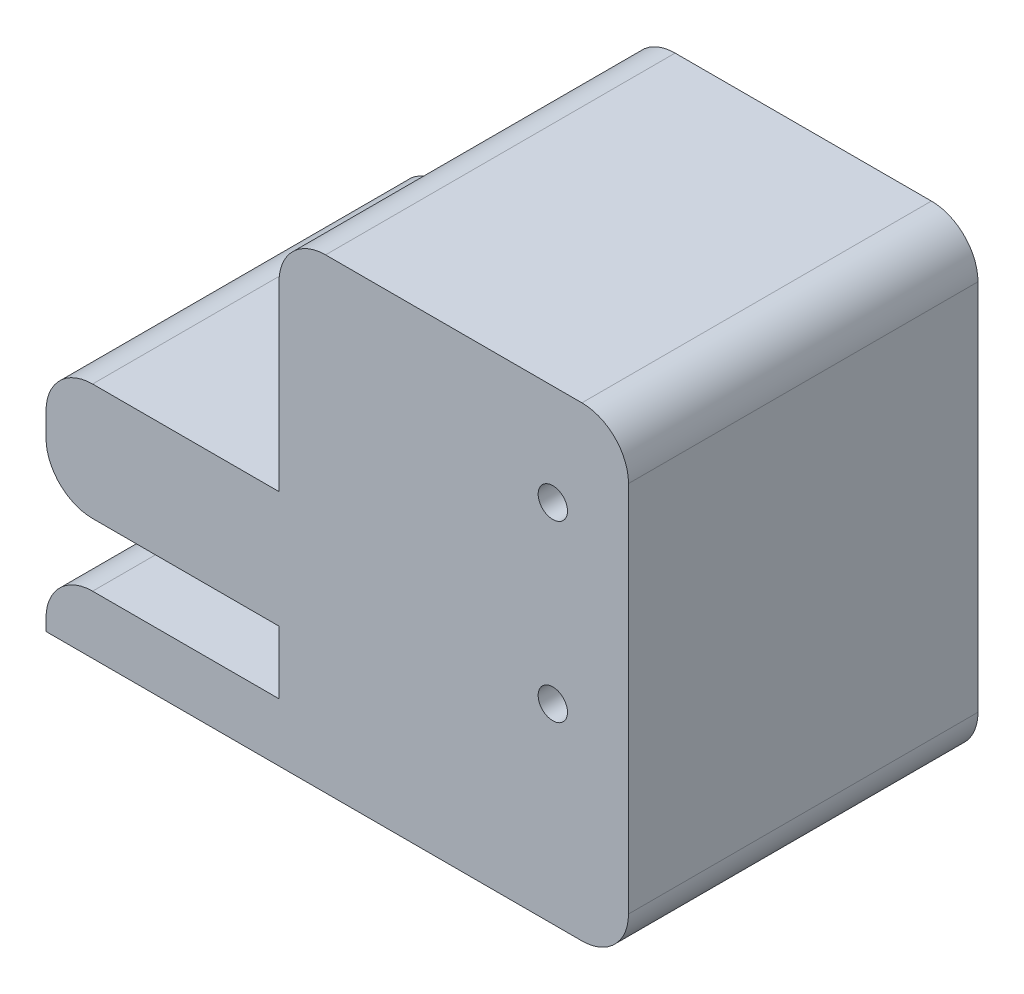
ISO-10303-21;
HEADER;
FILE_DESCRIPTION(('STEP AP214'),'2;1');
FILE_NAME('part.step','',(''),(''),'','','');
FILE_SCHEMA(('AUTOMOTIVE_DESIGN { 1 0 10303 214 1 1 1 1 }'));
ENDSEC;
DATA;
#1=APPLICATION_CONTEXT('core data for automotive mechanical design processes');
#2=APPLICATION_PROTOCOL_DEFINITION('international standard','automotive_design',2000,#1);
#3=PRODUCT_CONTEXT('',#1,'mechanical');
#4=PRODUCT('Part','Part','',(#3));
#5=PRODUCT_RELATED_PRODUCT_CATEGORY('part','',(#4));
#6=PRODUCT_DEFINITION_FORMATION('','',#4);
#7=PRODUCT_DEFINITION_CONTEXT('part definition',#1,'design');
#8=PRODUCT_DEFINITION('design','',#6,#7);
#9=PRODUCT_DEFINITION_SHAPE('','',#8);
#10=(LENGTH_UNIT() NAMED_UNIT(*) SI_UNIT(.MILLI.,.METRE.));
#11=(NAMED_UNIT(*) PLANE_ANGLE_UNIT() SI_UNIT($,.RADIAN.));
#12=(NAMED_UNIT(*) SI_UNIT($,.STERADIAN.) SOLID_ANGLE_UNIT());
#13=UNCERTAINTY_MEASURE_WITH_UNIT(LENGTH_MEASURE(1.E-05),#10,'distance_accuracy_value','');
#14=(GEOMETRIC_REPRESENTATION_CONTEXT(3) GLOBAL_UNCERTAINTY_ASSIGNED_CONTEXT((#13)) GLOBAL_UNIT_ASSIGNED_CONTEXT((#10,
#11,#12)) REPRESENTATION_CONTEXT('',''));
#15=CARTESIAN_POINT('',(0.,0.,0.));
#16=DIRECTION('',(0.,0.,1.));
#17=DIRECTION('',(1.,0.,0.));
#18=AXIS2_PLACEMENT_3D('',#15,#16,#17);
#19=CARTESIAN_POINT('',(0.,6.35,19.05));
#20=DIRECTION('',(1.,0.,0.));
#21=DIRECTION('',(0.,1.,0.));
#22=AXIS2_PLACEMENT_3D('',#19,#20,#21);
#23=PLANE('',#22);
#24=DIRECTION('',(0.,-1.,0.));
#25=VECTOR('',#24,1.);
#26=CARTESIAN_POINT('',(0.,6.35,19.05));
#27=LINE('',#26,#25);
#28=CARTESIAN_POINT('',(0.,3.81,19.05));
#29=VERTEX_POINT('',#28);
#30=CARTESIAN_POINT('',(0.,2.54,19.05));
#31=VERTEX_POINT('',#30);
#32=EDGE_CURVE('E163',#29,#31,#27,.T.);
#33=ORIENTED_EDGE('',*,*,#32,.F.);
#34=DIRECTION('',(0.,0.,-1.));
#35=VECTOR('',#34,1.);
#36=CARTESIAN_POINT('',(0.,3.81,19.05));
#37=LINE('',#36,#35);
#38=CARTESIAN_POINT('',(0.,3.81,0.));
#39=VERTEX_POINT('',#38);
#40=EDGE_CURVE('E230',#29,#39,#37,.T.);
#41=ORIENTED_EDGE('',*,*,#40,.T.);
#42=DIRECTION('',(0.,-1.,0.));
#43=VECTOR('',#42,1.);
#44=CARTESIAN_POINT('',(0.,6.35,0.));
#45=LINE('',#44,#43);
#46=CARTESIAN_POINT('',(0.,2.54,0.));
#47=VERTEX_POINT('',#46);
#48=EDGE_CURVE('E198',#39,#47,#45,.T.);
#49=ORIENTED_EDGE('',*,*,#48,.T.);
#50=DIRECTION('',(0.,0.,-1.));
#51=VECTOR('',#50,1.);
#52=CARTESIAN_POINT('',(0.,2.54,19.05));
#53=LINE('',#52,#51);
#54=EDGE_CURVE('E172',#47,#31,#53,.F.);
#55=ORIENTED_EDGE('',*,*,#54,.T.);
#56=EDGE_LOOP('',(#33,#41,#49,#55));
#57=FACE_BOUND('',#56,.T.);
#58=ADVANCED_FACE('F36',(#57),#23,.F.);
#59=CARTESIAN_POINT('',(0.,0.,19.05));
#60=DIRECTION('',(0.,1.,0.));
#61=DIRECTION('',(-1.,0.,0.));
#62=AXIS2_PLACEMENT_3D('',#59,#60,#61);
#63=PLANE('',#62);
#64=CARTESIAN_POINT('',(6.35,0.,9.525));
#65=DIRECTION('',(0.,1.,0.));
#66=DIRECTION('',(-1.,0.,0.));
#67=AXIS2_PLACEMENT_3D('',#64,#65,#66);
#68=CIRCLE('',#67,1.65);
#69=CARTESIAN_POINT('',(4.7,0.,9.525));
#70=VERTEX_POINT('',#69);
#71=EDGE_CURVE('E201',#70,#70,#68,.T.);
#72=ORIENTED_EDGE('',*,*,#71,.T.);
#73=EDGE_LOOP('',(#72));
#74=FACE_BOUND('',#73,.T.);
#75=DIRECTION('',(1.,0.,0.));
#76=VECTOR('',#75,1.);
#77=CARTESIAN_POINT('',(0.,0.,19.05));
#78=LINE('',#77,#76);
#79=CARTESIAN_POINT('',(2.54,0.,19.05));
#80=VERTEX_POINT('',#79);
#81=CARTESIAN_POINT('',(12.7,0.,19.05));
#82=VERTEX_POINT('',#81);
#83=EDGE_CURVE('E149',#80,#82,#78,.T.);
#84=ORIENTED_EDGE('',*,*,#83,.F.);
#85=DIRECTION('',(0.,0.,-1.));
#86=VECTOR('',#85,1.);
#87=CARTESIAN_POINT('',(2.54,0.,19.05));
#88=LINE('',#87,#86);
#89=CARTESIAN_POINT('',(2.54,0.,0.));
#90=VERTEX_POINT('',#89);
#91=EDGE_CURVE('E262',#80,#90,#88,.T.);
#92=ORIENTED_EDGE('',*,*,#91,.T.);
#93=DIRECTION('',(1.,0.,0.));
#94=VECTOR('',#93,1.);
#95=CARTESIAN_POINT('',(0.,0.,0.));
#96=LINE('',#95,#94);
#97=CARTESIAN_POINT('',(12.7,0.,0.));
#98=VERTEX_POINT('',#97);
#99=EDGE_CURVE('E169',#90,#98,#96,.T.);
#100=ORIENTED_EDGE('',*,*,#99,.T.);
#101=DIRECTION('',(0.,0.,-1.));
#102=VECTOR('',#101,1.);
#103=CARTESIAN_POINT('',(12.7,0.,19.05));
#104=LINE('',#103,#102);
#105=EDGE_CURVE('E166',#82,#98,#104,.T.);
#106=ORIENTED_EDGE('',*,*,#105,.F.);
#107=EDGE_LOOP('',(#84,#92,#100,#106));
#108=FACE_BOUND('',#107,.T.);
#109=ADVANCED_FACE('F167',(#74,#108),#63,.F.);
#110=CARTESIAN_POINT('',(12.7,0.,19.05));
#111=DIRECTION('',(1.,0.,0.));
#112=DIRECTION('',(0.,0.,-1.));
#113=AXIS2_PLACEMENT_3D('',#110,#111,#112);
#114=PLANE('',#113);
#115=DIRECTION('',(0.,-1.,0.));
#116=VECTOR('',#115,1.);
#117=CARTESIAN_POINT('',(12.7,0.,0.));
#118=LINE('',#117,#116);
#119=CARTESIAN_POINT('',(12.7,-3.429,0.));
#120=VERTEX_POINT('',#119);
#121=EDGE_CURVE('E203',#98,#120,#118,.T.);
#122=ORIENTED_EDGE('',*,*,#121,.T.);
#123=DIRECTION('',(0.,0.,-1.));
#124=VECTOR('',#123,1.);
#125=CARTESIAN_POINT('',(12.7,-3.429,19.05));
#126=LINE('',#125,#124);
#127=CARTESIAN_POINT('',(12.7,-3.429,19.05));
#128=VERTEX_POINT('',#127);
#129=EDGE_CURVE('E173',#128,#120,#126,.T.);
#130=ORIENTED_EDGE('',*,*,#129,.F.);
#131=DIRECTION('',(0.,-1.,0.));
#132=VECTOR('',#131,1.);
#133=CARTESIAN_POINT('',(12.7,0.,19.05));
#134=LINE('',#133,#132);
#135=EDGE_CURVE('E155',#82,#128,#134,.T.);
#136=ORIENTED_EDGE('',*,*,#135,.F.);
#137=ORIENTED_EDGE('',*,*,#105,.T.);
#138=EDGE_LOOP('',(#122,#130,#136,#137));
#139=FACE_BOUND('',#138,.T.);
#140=ADVANCED_FACE('F175',(#139),#114,.F.);
#141=CARTESIAN_POINT('',(12.7,-3.429,19.05));
#142=DIRECTION('',(0.,-1.,0.));
#143=DIRECTION('',(1.,0.,0.));
#144=AXIS2_PLACEMENT_3D('',#141,#142,#143);
#145=PLANE('',#144);
#146=DIRECTION('',(-1.,0.,0.));
#147=VECTOR('',#146,1.);
#148=CARTESIAN_POINT('',(12.7,-3.429,0.));
#149=LINE('',#148,#147);
#150=CARTESIAN_POINT('',(2.54,-3.429,0.));
#151=VERTEX_POINT('',#150);
#152=EDGE_CURVE('E205',#120,#151,#149,.T.);
#153=ORIENTED_EDGE('',*,*,#152,.T.);
#154=DIRECTION('',(0.,0.,-1.));
#155=VECTOR('',#154,1.);
#156=CARTESIAN_POINT('',(2.54,-3.429,19.05));
#157=LINE('',#156,#155);
#158=CARTESIAN_POINT('',(2.54,-3.429,19.05));
#159=VERTEX_POINT('',#158);
#160=EDGE_CURVE('E260',#151,#159,#157,.F.);
#161=ORIENTED_EDGE('',*,*,#160,.T.);
#162=DIRECTION('',(-1.,0.,0.));
#163=VECTOR('',#162,1.);
#164=CARTESIAN_POINT('',(12.7,-3.429,19.05));
#165=LINE('',#164,#163);
#166=EDGE_CURVE('E178',#128,#159,#165,.T.);
#167=ORIENTED_EDGE('',*,*,#166,.F.);
#168=ORIENTED_EDGE('',*,*,#129,.T.);
#169=EDGE_LOOP('',(#153,#161,#167,#168));
#170=FACE_BOUND('',#169,.T.);
#171=ADVANCED_FACE('F388',(#170),#145,.F.);
#172=CARTESIAN_POINT('',(0.,-3.429,19.05));
#173=DIRECTION('',(1.,0.,0.));
#174=DIRECTION('',(0.,1.,0.));
#175=AXIS2_PLACEMENT_3D('',#172,#173,#174);
#176=PLANE('',#175);
#177=DIRECTION('',(0.,-1.,0.));
#178=VECTOR('',#177,1.);
#179=CARTESIAN_POINT('',(0.,-3.429,19.05));
#180=LINE('',#179,#178);
#181=CARTESIAN_POINT('',(0.,-5.969,19.05));
#182=VERTEX_POINT('',#181);
#183=CARTESIAN_POINT('',(0.,-6.604,19.05));
#184=VERTEX_POINT('',#183);
#185=EDGE_CURVE('E180',#182,#184,#180,.T.);
#186=ORIENTED_EDGE('',*,*,#185,.F.);
#187=DIRECTION('',(0.,0.,-1.));
#188=VECTOR('',#187,1.);
#189=CARTESIAN_POINT('',(0.,-5.969,19.05));
#190=LINE('',#189,#188);
#191=CARTESIAN_POINT('',(0.,-5.969,0.));
#192=VERTEX_POINT('',#191);
#193=EDGE_CURVE('E257',#182,#192,#190,.T.);
#194=ORIENTED_EDGE('',*,*,#193,.T.);
#195=DIRECTION('',(0.,-1.,0.));
#196=VECTOR('',#195,1.);
#197=CARTESIAN_POINT('',(0.,-3.429,0.));
#198=LINE('',#197,#196);
#199=CARTESIAN_POINT('',(0.,-6.604,0.));
#200=VERTEX_POINT('',#199);
#201=EDGE_CURVE('E208',#192,#200,#198,.T.);
#202=ORIENTED_EDGE('',*,*,#201,.T.);
#203=DIRECTION('',(0.,0.,-1.));
#204=VECTOR('',#203,1.);
#205=CARTESIAN_POINT('',(0.,-6.604,19.05));
#206=LINE('',#205,#204);
#207=EDGE_CURVE('E225',#184,#200,#206,.T.);
#208=ORIENTED_EDGE('',*,*,#207,.F.);
#209=EDGE_LOOP('',(#186,#194,#202,#208));
#210=FACE_BOUND('',#209,.T.);
#211=ADVANCED_FACE('F383',(#210),#176,.F.);
#212=CARTESIAN_POINT('',(0.,-6.604,19.05));
#213=DIRECTION('',(0.,1.,0.));
#214=DIRECTION('',(-1.,0.,0.));
#215=AXIS2_PLACEMENT_3D('',#212,#213,#214);
#216=PLANE('',#215);
#217=DIRECTION('',(1.,0.,0.));
#218=VECTOR('',#217,1.);
#219=CARTESIAN_POINT('',(0.,-6.604,0.));
#220=LINE('',#219,#218);
#221=CARTESIAN_POINT('',(29.21,-6.604,0.));
#222=VERTEX_POINT('',#221);
#223=EDGE_CURVE('E210',#200,#222,#220,.T.);
#224=ORIENTED_EDGE('',*,*,#223,.T.);
#225=DIRECTION('',(0.,0.,-1.));
#226=VECTOR('',#225,1.);
#227=CARTESIAN_POINT('',(29.21,-6.604,19.05));
#228=LINE('',#227,#226);
#229=CARTESIAN_POINT('',(29.21,-6.604,19.05));
#230=VERTEX_POINT('',#229);
#231=EDGE_CURVE('E269',#222,#230,#228,.F.);
#232=ORIENTED_EDGE('',*,*,#231,.T.);
#233=DIRECTION('',(1.,0.,0.));
#234=VECTOR('',#233,1.);
#235=CARTESIAN_POINT('',(0.,-6.604,19.05));
#236=LINE('',#235,#234);
#237=EDGE_CURVE('E185',#184,#230,#236,.T.);
#238=ORIENTED_EDGE('',*,*,#237,.F.);
#239=ORIENTED_EDGE('',*,*,#207,.T.);
#240=EDGE_LOOP('',(#224,#232,#238,#239));
#241=FACE_BOUND('',#240,.T.);
#242=ADVANCED_FACE('F378',(#241),#216,.F.);
#243=CARTESIAN_POINT('',(31.75,-6.604,19.05));
#244=DIRECTION('',(-1.,0.,0.));
#245=DIRECTION('',(0.,-1.,0.));
#246=AXIS2_PLACEMENT_3D('',#243,#244,#245);
#247=PLANE('',#246);
#248=DIRECTION('',(0.,1.,0.));
#249=VECTOR('',#248,1.);
#250=CARTESIAN_POINT('',(31.75,-6.604,19.05));
#251=LINE('',#250,#249);
#252=CARTESIAN_POINT('',(31.75,-4.064,19.05));
#253=VERTEX_POINT('',#252);
#254=CARTESIAN_POINT('',(31.75,16.256,19.05));
#255=VERTEX_POINT('',#254);
#256=EDGE_CURVE('E188',#253,#255,#251,.T.);
#257=ORIENTED_EDGE('',*,*,#256,.F.);
#258=DIRECTION('',(0.,0.,-1.));
#259=VECTOR('',#258,1.);
#260=CARTESIAN_POINT('',(31.75,-4.064,19.05));
#261=LINE('',#260,#259);
#262=CARTESIAN_POINT('',(31.75,-4.064,0.));
#263=VERTEX_POINT('',#262);
#264=EDGE_CURVE('E266',#253,#263,#261,.T.);
#265=ORIENTED_EDGE('',*,*,#264,.T.);
#266=DIRECTION('',(0.,1.,0.));
#267=VECTOR('',#266,1.);
#268=CARTESIAN_POINT('',(31.75,-6.604,0.));
#269=LINE('',#268,#267);
#270=CARTESIAN_POINT('',(31.75,16.256,0.));
#271=VERTEX_POINT('',#270);
#272=EDGE_CURVE('E213',#263,#271,#269,.T.);
#273=ORIENTED_EDGE('',*,*,#272,.T.);
#274=DIRECTION('',(0.,0.,-1.));
#275=VECTOR('',#274,1.);
#276=CARTESIAN_POINT('',(31.75,16.256,19.05));
#277=LINE('',#276,#275);
#278=EDGE_CURVE('E264',#271,#255,#277,.F.);
#279=ORIENTED_EDGE('',*,*,#278,.T.);
#280=EDGE_LOOP('',(#257,#265,#273,#279));
#281=FACE_BOUND('',#280,.T.);
#282=ADVANCED_FACE('F373',(#281),#247,.F.);
#283=CARTESIAN_POINT('',(31.75,18.796,19.05));
#284=DIRECTION('',(0.,-1.,0.));
#285=DIRECTION('',(1.,0.,0.));
#286=AXIS2_PLACEMENT_3D('',#283,#284,#285);
#287=PLANE('',#286);
#288=DIRECTION('',(-1.,0.,0.));
#289=VECTOR('',#288,1.);
#290=CARTESIAN_POINT('',(31.75,18.796,19.05));
#291=LINE('',#290,#289);
#292=CARTESIAN_POINT('',(29.21,18.796,19.05));
#293=VERTEX_POINT('',#292);
#294=CARTESIAN_POINT('',(15.24,18.796,19.05));
#295=VERTEX_POINT('',#294);
#296=EDGE_CURVE('E191',#293,#295,#291,.T.);
#297=ORIENTED_EDGE('',*,*,#296,.F.);
#298=DIRECTION('',(0.,0.,-1.));
#299=VECTOR('',#298,1.);
#300=CARTESIAN_POINT('',(29.21,18.796,19.05));
#301=LINE('',#300,#299);
#302=CARTESIAN_POINT('',(29.21,18.796,0.));
#303=VERTEX_POINT('',#302);
#304=EDGE_CURVE('E44',#293,#303,#301,.T.);
#305=ORIENTED_EDGE('',*,*,#304,.T.);
#306=DIRECTION('',(-1.,0.,0.));
#307=VECTOR('',#306,1.);
#308=CARTESIAN_POINT('',(31.75,18.796,0.));
#309=LINE('',#308,#307);
#310=CARTESIAN_POINT('',(15.24,18.796,0.));
#311=VERTEX_POINT('',#310);
#312=EDGE_CURVE('E216',#303,#311,#309,.T.);
#313=ORIENTED_EDGE('',*,*,#312,.T.);
#314=DIRECTION('',(0.,0.,-1.));
#315=VECTOR('',#314,1.);
#316=CARTESIAN_POINT('',(15.24,18.796,19.05));
#317=LINE('',#316,#315);
#318=EDGE_CURVE('E59',#311,#295,#317,.F.);
#319=ORIENTED_EDGE('',*,*,#318,.T.);
#320=EDGE_LOOP('',(#297,#305,#313,#319));
#321=FACE_BOUND('',#320,.T.);
#322=ADVANCED_FACE('F274',(#321),#287,.F.);
#323=CARTESIAN_POINT('',(12.7,18.796,19.05));
#324=DIRECTION('',(1.,0.,0.));
#325=DIRECTION('',(0.,0.,-1.));
#326=AXIS2_PLACEMENT_3D('',#323,#324,#325);
#327=PLANE('',#326);
#328=DIRECTION('',(0.,-1.,0.));
#329=VECTOR('',#328,1.);
#330=CARTESIAN_POINT('',(12.7,18.796,19.05));
#331=LINE('',#330,#329);
#332=CARTESIAN_POINT('',(12.7,16.256,19.05));
#333=VERTEX_POINT('',#332);
#334=CARTESIAN_POINT('',(12.7,6.35,19.05));
#335=VERTEX_POINT('',#334);
#336=EDGE_CURVE('E193',#333,#335,#331,.T.);
#337=ORIENTED_EDGE('',*,*,#336,.F.);
#338=DIRECTION('',(0.,0.,-1.));
#339=VECTOR('',#338,1.);
#340=CARTESIAN_POINT('',(12.7,16.256,19.05));
#341=LINE('',#340,#339);
#342=CARTESIAN_POINT('',(12.7,16.256,0.));
#343=VERTEX_POINT('',#342);
#344=EDGE_CURVE('E11',#333,#343,#341,.T.);
#345=ORIENTED_EDGE('',*,*,#344,.T.);
#346=DIRECTION('',(0.,-1.,0.));
#347=VECTOR('',#346,1.);
#348=CARTESIAN_POINT('',(12.7,18.796,0.));
#349=LINE('',#348,#347);
#350=CARTESIAN_POINT('',(12.7,6.35,0.));
#351=VERTEX_POINT('',#350);
#352=EDGE_CURVE('E218',#343,#351,#349,.T.);
#353=ORIENTED_EDGE('',*,*,#352,.T.);
#354=DIRECTION('',(0.,0.,-1.));
#355=VECTOR('',#354,1.);
#356=CARTESIAN_POINT('',(12.7,6.35,19.05));
#357=LINE('',#356,#355);
#358=EDGE_CURVE('E197',#335,#351,#357,.T.);
#359=ORIENTED_EDGE('',*,*,#358,.F.);
#360=EDGE_LOOP('',(#337,#345,#353,#359));
#361=FACE_BOUND('',#360,.T.);
#362=ADVANCED_FACE('F286',(#361),#327,.F.);
#363=CARTESIAN_POINT('',(12.7,6.35,19.05));
#364=DIRECTION('',(0.,-1.,0.));
#365=DIRECTION('',(1.,0.,0.));
#366=AXIS2_PLACEMENT_3D('',#363,#364,#365);
#367=PLANE('',#366);
#368=CARTESIAN_POINT('',(6.35,6.35,9.525));
#369=DIRECTION('',(0.,1.,0.));
#370=DIRECTION('',(0.,0.,1.));
#371=AXIS2_PLACEMENT_3D('',#368,#369,#370);
#372=CIRCLE('',#371,1.65);
#373=CARTESIAN_POINT('',(6.35,6.35,11.175));
#374=VERTEX_POINT('',#373);
#375=EDGE_CURVE('E303',#374,#374,#372,.T.);
#376=ORIENTED_EDGE('',*,*,#375,.F.);
#377=EDGE_LOOP('',(#376));
#378=FACE_BOUND('',#377,.T.);
#379=DIRECTION('',(-1.,0.,0.));
#380=VECTOR('',#379,1.);
#381=CARTESIAN_POINT('',(12.7,6.35,0.));
#382=LINE('',#381,#380);
#383=CARTESIAN_POINT('',(2.54,6.35,0.));
#384=VERTEX_POINT('',#383);
#385=EDGE_CURVE('E220',#351,#384,#382,.T.);
#386=ORIENTED_EDGE('',*,*,#385,.T.);
#387=DIRECTION('',(0.,0.,-1.));
#388=VECTOR('',#387,1.);
#389=CARTESIAN_POINT('',(2.54,6.35,19.05));
#390=LINE('',#389,#388);
#391=CARTESIAN_POINT('',(2.54,6.35,19.05));
#392=VERTEX_POINT('',#391);
#393=EDGE_CURVE('E245',#384,#392,#390,.F.);
#394=ORIENTED_EDGE('',*,*,#393,.T.);
#395=DIRECTION('',(-1.,0.,0.));
#396=VECTOR('',#395,1.);
#397=CARTESIAN_POINT('',(12.7,6.35,19.05));
#398=LINE('',#397,#396);
#399=EDGE_CURVE('E195',#335,#392,#398,.T.);
#400=ORIENTED_EDGE('',*,*,#399,.F.);
#401=ORIENTED_EDGE('',*,*,#358,.T.);
#402=EDGE_LOOP('',(#386,#394,#400,#401));
#403=FACE_BOUND('',#402,.T.);
#404=ADVANCED_FACE('F323',(#378,#403),#367,.F.);
#405=CARTESIAN_POINT('',(0.,0.,19.05));
#406=DIRECTION('',(0.,0.,1.));
#407=DIRECTION('',(1.,0.,0.));
#408=AXIS2_PLACEMENT_3D('',#405,#406,#407);
#409=PLANE('',#408);
#410=CARTESIAN_POINT('',(27.625,13.296,19.05));
#411=DIRECTION('',(0.,0.,1.));
#412=DIRECTION('',(1.,0.,0.));
#413=AXIS2_PLACEMENT_3D('',#410,#411,#412);
#414=CIRCLE('',#413,0.799999999999999);
#415=CARTESIAN_POINT('',(28.425,13.296,19.05));
#416=VERTEX_POINT('',#415);
#417=EDGE_CURVE('E315',#416,#416,#414,.T.);
#418=ORIENTED_EDGE('',*,*,#417,.F.);
#419=EDGE_LOOP('',(#418));
#420=FACE_BOUND('',#419,.T.);
#421=CARTESIAN_POINT('',(27.625,3.79600000000001,19.05));
#422=DIRECTION('',(0.,0.,1.));
#423=DIRECTION('',(1.,0.,0.));
#424=AXIS2_PLACEMENT_3D('',#421,#422,#423);
#425=CIRCLE('',#424,0.799999999999999);
#426=CARTESIAN_POINT('',(28.425,3.79600000000001,19.05));
#427=VERTEX_POINT('',#426);
#428=EDGE_CURVE('E309',#427,#427,#425,.T.);
#429=ORIENTED_EDGE('',*,*,#428,.F.);
#430=EDGE_LOOP('',(#429));
#431=FACE_BOUND('',#430,.T.);
#432=ORIENTED_EDGE('',*,*,#399,.T.);
#433=CARTESIAN_POINT('',(2.54,3.81,19.05));
#434=DIRECTION('',(0.,0.,1.));
#435=DIRECTION('',(1.,0.,0.));
#436=AXIS2_PLACEMENT_3D('',#433,#434,#435);
#437=CIRCLE('',#436,2.54);
#438=EDGE_CURVE('E255',#392,#29,#437,.T.);
#439=ORIENTED_EDGE('',*,*,#438,.T.);
#440=ORIENTED_EDGE('',*,*,#32,.T.);
#441=CARTESIAN_POINT('',(2.54,2.54,19.05));
#442=DIRECTION('',(0.,0.,1.));
#443=DIRECTION('',(1.,0.,0.));
#444=AXIS2_PLACEMENT_3D('',#441,#442,#443);
#445=CIRCLE('',#444,2.54);
#446=EDGE_CURVE('E159',#31,#80,#445,.T.);
#447=ORIENTED_EDGE('',*,*,#446,.T.);
#448=ORIENTED_EDGE('',*,*,#83,.T.);
#449=ORIENTED_EDGE('',*,*,#135,.T.);
#450=ORIENTED_EDGE('',*,*,#166,.T.);
#451=CARTESIAN_POINT('',(2.54,-5.969,19.05));
#452=DIRECTION('',(0.,0.,1.));
#453=DIRECTION('',(1.,0.,0.));
#454=AXIS2_PLACEMENT_3D('',#451,#452,#453);
#455=CIRCLE('',#454,2.54);
#456=EDGE_CURVE('E253',#159,#182,#455,.T.);
#457=ORIENTED_EDGE('',*,*,#456,.T.);
#458=ORIENTED_EDGE('',*,*,#185,.T.);
#459=ORIENTED_EDGE('',*,*,#237,.T.);
#460=CARTESIAN_POINT('',(29.21,-4.064,19.05));
#461=DIRECTION('',(0.,0.,1.));
#462=DIRECTION('',(1.,0.,0.));
#463=AXIS2_PLACEMENT_3D('',#460,#461,#462);
#464=CIRCLE('',#463,2.54);
#465=EDGE_CURVE('E250',#230,#253,#464,.T.);
#466=ORIENTED_EDGE('',*,*,#465,.T.);
#467=ORIENTED_EDGE('',*,*,#256,.T.);
#468=CARTESIAN_POINT('',(29.21,16.256,19.05));
#469=DIRECTION('',(0.,0.,1.));
#470=DIRECTION('',(1.,0.,0.));
#471=AXIS2_PLACEMENT_3D('',#468,#469,#470);
#472=CIRCLE('',#471,2.54);
#473=EDGE_CURVE('E248',#255,#293,#472,.T.);
#474=ORIENTED_EDGE('',*,*,#473,.T.);
#475=ORIENTED_EDGE('',*,*,#296,.T.);
#476=CARTESIAN_POINT('',(15.24,16.256,19.05));
#477=DIRECTION('',(0.,0.,1.));
#478=DIRECTION('',(1.,0.,0.));
#479=AXIS2_PLACEMENT_3D('',#476,#477,#478);
#480=CIRCLE('',#479,2.54);
#481=EDGE_CURVE('E51',#295,#333,#480,.T.);
#482=ORIENTED_EDGE('',*,*,#481,.T.);
#483=ORIENTED_EDGE('',*,*,#336,.T.);
#484=EDGE_LOOP('',(#432,#439,#440,#447,#448,#449,#450,#457,#458,#459,#466,#467,#474,#475,#482,#483));
#485=FACE_BOUND('',#484,.T.);
#486=ADVANCED_FACE('F152',(#420,#431,#485),#409,.T.);
#487=CARTESIAN_POINT('',(0.,0.,0.));
#488=DIRECTION('',(0.,0.,1.));
#489=DIRECTION('',(1.,0.,0.));
#490=AXIS2_PLACEMENT_3D('',#487,#488,#489);
#491=PLANE('',#490);
#492=CARTESIAN_POINT('',(27.625,13.296,0.));
#493=DIRECTION('',(0.,0.,1.));
#494=DIRECTION('',(1.,0.,0.));
#495=AXIS2_PLACEMENT_3D('',#492,#493,#494);
#496=CIRCLE('',#495,0.799999999999997);
#497=CARTESIAN_POINT('',(28.425,13.296,0.));
#498=VERTEX_POINT('',#497);
#499=EDGE_CURVE('E312',#498,#498,#496,.T.);
#500=ORIENTED_EDGE('',*,*,#499,.T.);
#501=EDGE_LOOP('',(#500));
#502=FACE_BOUND('',#501,.T.);
#503=CARTESIAN_POINT('',(27.625,3.79600000000001,0.));
#504=DIRECTION('',(0.,0.,1.));
#505=DIRECTION('',(1.,0.,0.));
#506=AXIS2_PLACEMENT_3D('',#503,#504,#505);
#507=CIRCLE('',#506,0.799999999999997);
#508=CARTESIAN_POINT('',(28.425,3.79600000000001,0.));
#509=VERTEX_POINT('',#508);
#510=EDGE_CURVE('E306',#509,#509,#507,.T.);
#511=ORIENTED_EDGE('',*,*,#510,.T.);
#512=EDGE_LOOP('',(#511));
#513=FACE_BOUND('',#512,.T.);
#514=ORIENTED_EDGE('',*,*,#48,.F.);
#515=CARTESIAN_POINT('',(2.54,3.81,0.));
#516=DIRECTION('',(0.,0.,1.));
#517=DIRECTION('',(1.,0.,0.));
#518=AXIS2_PLACEMENT_3D('',#515,#516,#517);
#519=CIRCLE('',#518,2.54);
#520=EDGE_CURVE('E243',#39,#384,#519,.F.);
#521=ORIENTED_EDGE('',*,*,#520,.T.);
#522=ORIENTED_EDGE('',*,*,#385,.F.);
#523=ORIENTED_EDGE('',*,*,#352,.F.);
#524=CARTESIAN_POINT('',(15.24,16.256,0.));
#525=DIRECTION('',(0.,0.,1.));
#526=DIRECTION('',(1.,0.,0.));
#527=AXIS2_PLACEMENT_3D('',#524,#525,#526);
#528=CIRCLE('',#527,2.54);
#529=EDGE_CURVE('E233',#343,#311,#528,.F.);
#530=ORIENTED_EDGE('',*,*,#529,.T.);
#531=ORIENTED_EDGE('',*,*,#312,.F.);
#532=CARTESIAN_POINT('',(29.21,16.256,0.));
#533=DIRECTION('',(0.,0.,1.));
#534=DIRECTION('',(1.,0.,0.));
#535=AXIS2_PLACEMENT_3D('',#532,#533,#534);
#536=CIRCLE('',#535,2.54);
#537=EDGE_CURVE('E235',#303,#271,#536,.F.);
#538=ORIENTED_EDGE('',*,*,#537,.T.);
#539=ORIENTED_EDGE('',*,*,#272,.F.);
#540=CARTESIAN_POINT('',(29.21,-4.064,0.));
#541=DIRECTION('',(0.,0.,1.));
#542=DIRECTION('',(1.,0.,0.));
#543=AXIS2_PLACEMENT_3D('',#540,#541,#542);
#544=CIRCLE('',#543,2.54);
#545=EDGE_CURVE('E237',#263,#222,#544,.F.);
#546=ORIENTED_EDGE('',*,*,#545,.T.);
#547=ORIENTED_EDGE('',*,*,#223,.F.);
#548=ORIENTED_EDGE('',*,*,#201,.F.);
#549=CARTESIAN_POINT('',(2.54,-5.969,0.));
#550=DIRECTION('',(0.,0.,1.));
#551=DIRECTION('',(1.,0.,0.));
#552=AXIS2_PLACEMENT_3D('',#549,#550,#551);
#553=CIRCLE('',#552,2.54);
#554=EDGE_CURVE('E241',#192,#151,#553,.F.);
#555=ORIENTED_EDGE('',*,*,#554,.T.);
#556=ORIENTED_EDGE('',*,*,#152,.F.);
#557=ORIENTED_EDGE('',*,*,#121,.F.);
#558=ORIENTED_EDGE('',*,*,#99,.F.);
#559=CARTESIAN_POINT('',(2.54,2.54,0.));
#560=DIRECTION('',(0.,0.,1.));
#561=DIRECTION('',(1.,0.,0.));
#562=AXIS2_PLACEMENT_3D('',#559,#560,#561);
#563=CIRCLE('',#562,2.54);
#564=EDGE_CURVE('E239',#90,#47,#563,.F.);
#565=ORIENTED_EDGE('',*,*,#564,.T.);
#566=EDGE_LOOP('',(#514,#521,#522,#523,#530,#531,#538,#539,#546,#547,#548,#555,#556,#557,#558,#565));
#567=FACE_BOUND('',#566,.T.);
#568=ADVANCED_FACE('F279',(#502,#513,#567),#491,.F.);
#569=CARTESIAN_POINT('',(6.35,6.35,9.525));
#570=DIRECTION('',(0.,1.,0.));
#571=DIRECTION('',(0.,0.,1.));
#572=AXIS2_PLACEMENT_3D('',#569,#570,#571);
#573=CYLINDRICAL_SURFACE('',#572,1.65);
#574=ORIENTED_EDGE('',*,*,#71,.F.);
#575=EDGE_LOOP('',(#574));
#576=FACE_BOUND('',#575,.T.);
#577=ORIENTED_EDGE('',*,*,#375,.T.);
#578=EDGE_LOOP('',(#577));
#579=FACE_BOUND('',#578,.T.);
#580=ADVANCED_FACE('F329',(#576,#579),#573,.F.);
#581=CARTESIAN_POINT('',(27.625,3.79600000000001,19.05));
#582=DIRECTION('',(0.,0.,1.));
#583=DIRECTION('',(1.,0.,0.));
#584=AXIS2_PLACEMENT_3D('',#581,#582,#583);
#585=CYLINDRICAL_SURFACE('',#584,0.799999999999997);
#586=ORIENTED_EDGE('',*,*,#510,.F.);
#587=EDGE_LOOP('',(#586));
#588=FACE_BOUND('',#587,.T.);
#589=ORIENTED_EDGE('',*,*,#428,.T.);
#590=EDGE_LOOP('',(#589));
#591=FACE_BOUND('',#590,.T.);
#592=ADVANCED_FACE('F327',(#588,#591),#585,.F.);
#593=CARTESIAN_POINT('',(27.625,13.296,19.05));
#594=DIRECTION('',(0.,0.,1.));
#595=DIRECTION('',(1.,0.,0.));
#596=AXIS2_PLACEMENT_3D('',#593,#594,#595);
#597=CYLINDRICAL_SURFACE('',#596,0.799999999999997);
#598=ORIENTED_EDGE('',*,*,#499,.F.);
#599=EDGE_LOOP('',(#598));
#600=FACE_BOUND('',#599,.T.);
#601=ORIENTED_EDGE('',*,*,#417,.T.);
#602=EDGE_LOOP('',(#601));
#603=FACE_BOUND('',#602,.T.);
#604=ADVANCED_FACE('F319',(#600,#603),#597,.F.);
#605=CARTESIAN_POINT('',(2.54,3.81,19.05));
#606=DIRECTION('',(0.,0.,-1.));
#607=DIRECTION('',(-1.,0.,0.));
#608=AXIS2_PLACEMENT_3D('',#605,#606,#607);
#609=CYLINDRICAL_SURFACE('',#608,2.54);
#610=ORIENTED_EDGE('',*,*,#438,.F.);
#611=ORIENTED_EDGE('',*,*,#393,.F.);
#612=ORIENTED_EDGE('',*,*,#520,.F.);
#613=ORIENTED_EDGE('',*,*,#40,.F.);
#614=EDGE_LOOP('',(#610,#611,#612,#613));
#615=FACE_BOUND('',#614,.T.);
#616=ADVANCED_FACE('F295',(#615),#609,.T.);
#617=CARTESIAN_POINT('',(2.54,-5.969,19.05));
#618=DIRECTION('',(0.,0.,-1.));
#619=DIRECTION('',(-1.,0.,0.));
#620=AXIS2_PLACEMENT_3D('',#617,#618,#619);
#621=CYLINDRICAL_SURFACE('',#620,2.54);
#622=ORIENTED_EDGE('',*,*,#456,.F.);
#623=ORIENTED_EDGE('',*,*,#160,.F.);
#624=ORIENTED_EDGE('',*,*,#554,.F.);
#625=ORIENTED_EDGE('',*,*,#193,.F.);
#626=EDGE_LOOP('',(#622,#623,#624,#625));
#627=FACE_BOUND('',#626,.T.);
#628=ADVANCED_FACE('F354',(#627),#621,.T.);
#629=CARTESIAN_POINT('',(2.54,2.54,19.05));
#630=DIRECTION('',(0.,0.,-1.));
#631=DIRECTION('',(-1.,0.,0.));
#632=AXIS2_PLACEMENT_3D('',#629,#630,#631);
#633=CYLINDRICAL_SURFACE('',#632,2.54);
#634=ORIENTED_EDGE('',*,*,#446,.F.);
#635=ORIENTED_EDGE('',*,*,#54,.F.);
#636=ORIENTED_EDGE('',*,*,#564,.F.);
#637=ORIENTED_EDGE('',*,*,#91,.F.);
#638=EDGE_LOOP('',(#634,#635,#636,#637));
#639=FACE_BOUND('',#638,.T.);
#640=ADVANCED_FACE('F299',(#639),#633,.T.);
#641=CARTESIAN_POINT('',(29.21,-4.064,19.05));
#642=DIRECTION('',(0.,0.,-1.));
#643=DIRECTION('',(-1.,0.,0.));
#644=AXIS2_PLACEMENT_3D('',#641,#642,#643);
#645=CYLINDRICAL_SURFACE('',#644,2.54);
#646=ORIENTED_EDGE('',*,*,#465,.F.);
#647=ORIENTED_EDGE('',*,*,#231,.F.);
#648=ORIENTED_EDGE('',*,*,#545,.F.);
#649=ORIENTED_EDGE('',*,*,#264,.F.);
#650=EDGE_LOOP('',(#646,#647,#648,#649));
#651=FACE_BOUND('',#650,.T.);
#652=ADVANCED_FACE('F360',(#651),#645,.T.);
#653=CARTESIAN_POINT('',(29.21,16.256,19.05));
#654=DIRECTION('',(0.,0.,-1.));
#655=DIRECTION('',(-1.,0.,0.));
#656=AXIS2_PLACEMENT_3D('',#653,#654,#655);
#657=CYLINDRICAL_SURFACE('',#656,2.54);
#658=ORIENTED_EDGE('',*,*,#473,.F.);
#659=ORIENTED_EDGE('',*,*,#278,.F.);
#660=ORIENTED_EDGE('',*,*,#537,.F.);
#661=ORIENTED_EDGE('',*,*,#304,.F.);
#662=EDGE_LOOP('',(#658,#659,#660,#661));
#663=FACE_BOUND('',#662,.T.);
#664=ADVANCED_FACE('F362',(#663),#657,.T.);
#665=CARTESIAN_POINT('',(15.24,16.256,19.05));
#666=DIRECTION('',(0.,0.,-1.));
#667=DIRECTION('',(-1.,0.,0.));
#668=AXIS2_PLACEMENT_3D('',#665,#666,#667);
#669=CYLINDRICAL_SURFACE('',#668,2.54);
#670=ORIENTED_EDGE('',*,*,#481,.F.);
#671=ORIENTED_EDGE('',*,*,#318,.F.);
#672=ORIENTED_EDGE('',*,*,#529,.F.);
#673=ORIENTED_EDGE('',*,*,#344,.F.);
#674=EDGE_LOOP('',(#670,#671,#672,#673));
#675=FACE_BOUND('',#674,.T.);
#676=ADVANCED_FACE('F38',(#675),#669,.T.);
#677=CLOSED_SHELL('',(#58,#109,#140,#171,#211,#242,#282,#322,#362,#404,#486,#568,#580,#592,#604,
#616,#628,#640,#652,#664,#676));
#678=MANIFOLD_SOLID_BREP('B2',#677);
#679=ADVANCED_BREP_SHAPE_REPRESENTATION('',(#18,#678),#14);
#680=SHAPE_DEFINITION_REPRESENTATION(#9,#679);
ENDSEC;
END-ISO-10303-21;
